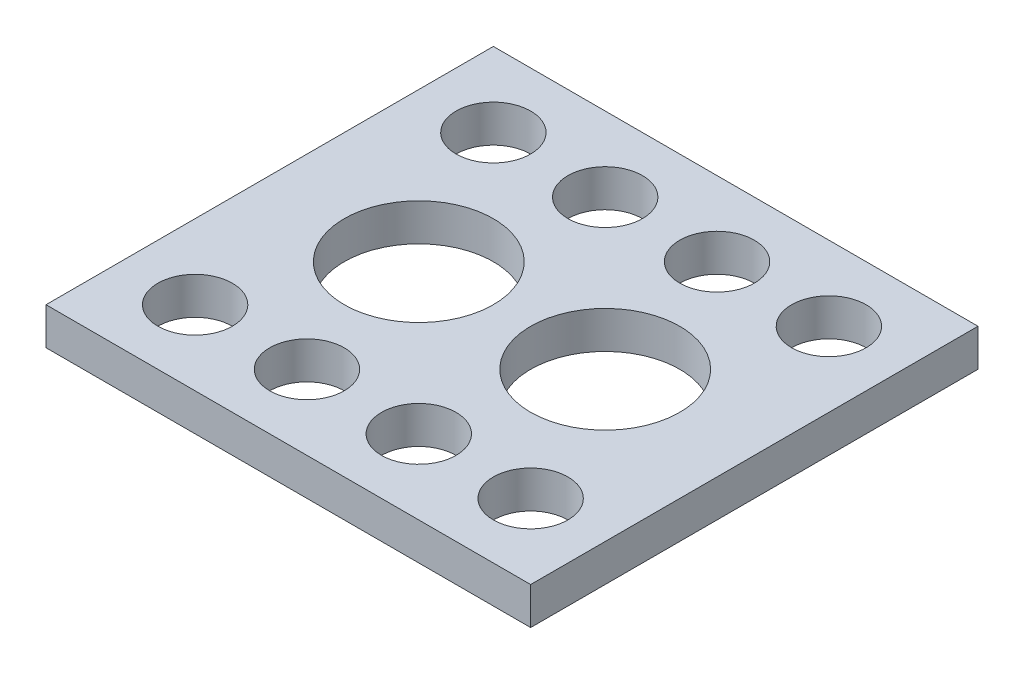
ISO-10303-21;
HEADER;
FILE_DESCRIPTION(('STEP AP214'),'2;1');
FILE_NAME('part.step','',(''),(''),'','','');
FILE_SCHEMA(('AUTOMOTIVE_DESIGN { 1 0 10303 214 1 1 1 1 }'));
ENDSEC;
DATA;
#1=APPLICATION_CONTEXT('core data for automotive mechanical design processes');
#2=APPLICATION_PROTOCOL_DEFINITION('international standard','automotive_design',2000,#1);
#3=PRODUCT_CONTEXT('',#1,'mechanical');
#4=PRODUCT('Part','Part','',(#3));
#5=PRODUCT_RELATED_PRODUCT_CATEGORY('part','',(#4));
#6=PRODUCT_DEFINITION_FORMATION('','',#4);
#7=PRODUCT_DEFINITION_CONTEXT('part definition',#1,'design');
#8=PRODUCT_DEFINITION('design','',#6,#7);
#9=PRODUCT_DEFINITION_SHAPE('','',#8);
#10=(LENGTH_UNIT() NAMED_UNIT(*) SI_UNIT(.MILLI.,.METRE.));
#11=(NAMED_UNIT(*) PLANE_ANGLE_UNIT() SI_UNIT($,.RADIAN.));
#12=(NAMED_UNIT(*) SI_UNIT($,.STERADIAN.) SOLID_ANGLE_UNIT());
#13=UNCERTAINTY_MEASURE_WITH_UNIT(LENGTH_MEASURE(1.E-05),#10,'distance_accuracy_value','');
#14=(GEOMETRIC_REPRESENTATION_CONTEXT(3) GLOBAL_UNCERTAINTY_ASSIGNED_CONTEXT((#13)) GLOBAL_UNIT_ASSIGNED_CONTEXT((#10,
#11,#12)) REPRESENTATION_CONTEXT('',''));
#15=CARTESIAN_POINT('',(0.,0.,0.));
#16=DIRECTION('',(0.,0.,1.));
#17=DIRECTION('',(1.,0.,0.));
#18=AXIS2_PLACEMENT_3D('',#15,#16,#17);
#19=CARTESIAN_POINT('',(0.,-12.7,0.));
#20=DIRECTION('',(-1.,0.,0.));
#21=DIRECTION('',(0.,0.,1.));
#22=AXIS2_PLACEMENT_3D('',#19,#20,#21);
#23=PLANE('',#22);
#24=DIRECTION('',(0.,0.,1.));
#25=VECTOR('',#24,1.);
#26=CARTESIAN_POINT('',(0.,0.,0.));
#27=LINE('',#26,#25);
#28=CARTESIAN_POINT('',(0.,0.,-152.4));
#29=VERTEX_POINT('',#28);
#30=CARTESIAN_POINT('',(0.,0.,0.));
#31=VERTEX_POINT('',#30);
#32=EDGE_CURVE('E116',#29,#31,#27,.T.);
#33=ORIENTED_EDGE('',*,*,#32,.F.);
#34=DIRECTION('',(0.,1.,0.));
#35=VECTOR('',#34,1.);
#36=CARTESIAN_POINT('',(0.,-12.7,-152.4));
#37=LINE('',#36,#35);
#38=CARTESIAN_POINT('',(0.,-12.7,-152.4));
#39=VERTEX_POINT('',#38);
#40=EDGE_CURVE('E11',#39,#29,#37,.T.);
#41=ORIENTED_EDGE('',*,*,#40,.F.);
#42=DIRECTION('',(0.,0.,1.));
#43=VECTOR('',#42,1.);
#44=CARTESIAN_POINT('',(0.,-12.7,0.));
#45=LINE('',#44,#43);
#46=CARTESIAN_POINT('',(0.,-12.7,0.));
#47=VERTEX_POINT('',#46);
#48=EDGE_CURVE('E105',#39,#47,#45,.T.);
#49=ORIENTED_EDGE('',*,*,#48,.T.);
#50=DIRECTION('',(0.,1.,0.));
#51=VECTOR('',#50,1.);
#52=CARTESIAN_POINT('',(0.,-12.7,0.));
#53=LINE('',#52,#51);
#54=EDGE_CURVE('E46',#47,#31,#53,.T.);
#55=ORIENTED_EDGE('',*,*,#54,.T.);
#56=EDGE_LOOP('',(#33,#41,#49,#55));
#57=FACE_BOUND('',#56,.T.);
#58=ADVANCED_FACE('F43',(#57),#23,.T.);
#59=CARTESIAN_POINT('',(0.,-12.7,-152.4));
#60=DIRECTION('',(0.,0.,-1.));
#61=DIRECTION('',(-1.,0.,0.));
#62=AXIS2_PLACEMENT_3D('',#59,#60,#61);
#63=PLANE('',#62);
#64=DIRECTION('',(-1.,0.,0.));
#65=VECTOR('',#64,1.);
#66=CARTESIAN_POINT('',(0.,0.,-152.4));
#67=LINE('',#66,#65);
#68=CARTESIAN_POINT('',(165.1,0.,-152.4));
#69=VERTEX_POINT('',#68);
#70=EDGE_CURVE('E110',#69,#29,#67,.T.);
#71=ORIENTED_EDGE('',*,*,#70,.F.);
#72=DIRECTION('',(0.,1.,0.));
#73=VECTOR('',#72,1.);
#74=CARTESIAN_POINT('',(165.1,-12.7,-152.4));
#75=LINE('',#74,#73);
#76=CARTESIAN_POINT('',(165.1,-12.7,-152.4));
#77=VERTEX_POINT('',#76);
#78=EDGE_CURVE('E53',#77,#69,#75,.T.);
#79=ORIENTED_EDGE('',*,*,#78,.F.);
#80=DIRECTION('',(-1.,0.,0.));
#81=VECTOR('',#80,1.);
#82=CARTESIAN_POINT('',(0.,-12.7,-152.4));
#83=LINE('',#82,#81);
#84=EDGE_CURVE('E100',#77,#39,#83,.T.);
#85=ORIENTED_EDGE('',*,*,#84,.T.);
#86=ORIENTED_EDGE('',*,*,#40,.T.);
#87=EDGE_LOOP('',(#71,#79,#85,#86));
#88=FACE_BOUND('',#87,.T.);
#89=ADVANCED_FACE('F297',(#88),#63,.T.);
#90=CARTESIAN_POINT('',(165.1,-12.7,0.));
#91=DIRECTION('',(1.,0.,0.));
#92=DIRECTION('',(0.,0.,-1.));
#93=AXIS2_PLACEMENT_3D('',#90,#91,#92);
#94=PLANE('',#93);
#95=DIRECTION('',(0.,0.,-1.));
#96=VECTOR('',#95,1.);
#97=CARTESIAN_POINT('',(165.1,0.,0.));
#98=LINE('',#97,#96);
#99=CARTESIAN_POINT('',(165.1,0.,0.));
#100=VERTEX_POINT('',#99);
#101=EDGE_CURVE('E94',#100,#69,#98,.T.);
#102=ORIENTED_EDGE('',*,*,#101,.F.);
#103=DIRECTION('',(0.,1.,0.));
#104=VECTOR('',#103,1.);
#105=CARTESIAN_POINT('',(165.1,-12.7,0.));
#106=LINE('',#105,#104);
#107=CARTESIAN_POINT('',(165.1,-12.7,0.));
#108=VERTEX_POINT('',#107);
#109=EDGE_CURVE('E89',#108,#100,#106,.T.);
#110=ORIENTED_EDGE('',*,*,#109,.F.);
#111=DIRECTION('',(0.,0.,-1.));
#112=VECTOR('',#111,1.);
#113=CARTESIAN_POINT('',(165.1,-12.7,0.));
#114=LINE('',#113,#112);
#115=EDGE_CURVE('E92',#108,#77,#114,.T.);
#116=ORIENTED_EDGE('',*,*,#115,.T.);
#117=ORIENTED_EDGE('',*,*,#78,.T.);
#118=EDGE_LOOP('',(#102,#110,#116,#117));
#119=FACE_BOUND('',#118,.T.);
#120=ADVANCED_FACE('F91',(#119),#94,.T.);
#121=CARTESIAN_POINT('',(0.,-12.7,0.));
#122=DIRECTION('',(0.,0.,1.));
#123=DIRECTION('',(1.,0.,0.));
#124=AXIS2_PLACEMENT_3D('',#121,#122,#123);
#125=PLANE('',#124);
#126=DIRECTION('',(1.,0.,0.));
#127=VECTOR('',#126,1.);
#128=CARTESIAN_POINT('',(0.,0.,0.));
#129=LINE('',#128,#127);
#130=EDGE_CURVE('E120',#31,#100,#129,.T.);
#131=ORIENTED_EDGE('',*,*,#130,.F.);
#132=ORIENTED_EDGE('',*,*,#54,.F.);
#133=DIRECTION('',(1.,0.,0.));
#134=VECTOR('',#133,1.);
#135=CARTESIAN_POINT('',(0.,-12.7,0.));
#136=LINE('',#135,#134);
#137=EDGE_CURVE('E99',#47,#108,#136,.T.);
#138=ORIENTED_EDGE('',*,*,#137,.T.);
#139=ORIENTED_EDGE('',*,*,#109,.T.);
#140=EDGE_LOOP('',(#131,#132,#138,#139));
#141=FACE_BOUND('',#140,.T.);
#142=ADVANCED_FACE('F103',(#141),#125,.T.);
#143=CARTESIAN_POINT('',(0.,-12.7,0.));
#144=DIRECTION('',(0.,-1.,0.));
#145=DIRECTION('',(0.,0.,-1.));
#146=AXIS2_PLACEMENT_3D('',#143,#144,#145);
#147=PLANE('',#146);
#148=CARTESIAN_POINT('',(50.8,-12.7,-76.2));
#149=DIRECTION('',(0.,1.,0.));
#150=DIRECTION('',(0.,0.,1.));
#151=AXIS2_PLACEMENT_3D('',#148,#149,#150);
#152=CIRCLE('',#151,25.4);
#153=CARTESIAN_POINT('',(50.8,-12.7,-50.8));
#154=VERTEX_POINT('',#153);
#155=EDGE_CURVE('E246',#154,#154,#152,.T.);
#156=ORIENTED_EDGE('',*,*,#155,.T.);
#157=EDGE_LOOP('',(#156));
#158=FACE_BOUND('',#157,.T.);
#159=CARTESIAN_POINT('',(114.3,-12.7,-76.2));
#160=DIRECTION('',(0.,1.,0.));
#161=DIRECTION('',(0.,0.,1.));
#162=AXIS2_PLACEMENT_3D('',#159,#160,#161);
#163=CIRCLE('',#162,25.4);
#164=CARTESIAN_POINT('',(114.3,-12.7,-50.8));
#165=VERTEX_POINT('',#164);
#166=EDGE_CURVE('E258',#165,#165,#163,.T.);
#167=ORIENTED_EDGE('',*,*,#166,.T.);
#168=EDGE_LOOP('',(#167));
#169=FACE_BOUND('',#168,.T.);
#170=CARTESIAN_POINT('',(63.5000000000011,-12.7,-25.4));
#171=DIRECTION('',(0.,1.,0.));
#172=DIRECTION('',(0.,0.,1.));
#173=AXIS2_PLACEMENT_3D('',#170,#171,#172);
#174=CIRCLE('',#173,12.7);
#175=CARTESIAN_POINT('',(63.5000000000011,-12.7,-12.7));
#176=VERTEX_POINT('',#175);
#177=EDGE_CURVE('E198',#176,#176,#174,.T.);
#178=ORIENTED_EDGE('',*,*,#177,.T.);
#179=EDGE_LOOP('',(#178));
#180=FACE_BOUND('',#179,.T.);
#181=CARTESIAN_POINT('',(139.7,-12.7,-127.));
#182=DIRECTION('',(0.,1.,0.));
#183=DIRECTION('',(0.,0.,1.));
#184=AXIS2_PLACEMENT_3D('',#181,#182,#183);
#185=CIRCLE('',#184,12.7);
#186=CARTESIAN_POINT('',(139.7,-12.7,-114.3));
#187=VERTEX_POINT('',#186);
#188=EDGE_CURVE('E186',#187,#187,#185,.T.);
#189=ORIENTED_EDGE('',*,*,#188,.T.);
#190=EDGE_LOOP('',(#189));
#191=FACE_BOUND('',#190,.T.);
#192=CARTESIAN_POINT('',(101.6,-12.7,-127.));
#193=DIRECTION('',(0.,1.,0.));
#194=DIRECTION('',(0.,0.,1.));
#195=AXIS2_PLACEMENT_3D('',#192,#193,#194);
#196=CIRCLE('',#195,12.7);
#197=CARTESIAN_POINT('',(101.6,-12.7,-114.3));
#198=VERTEX_POINT('',#197);
#199=EDGE_CURVE('E174',#198,#198,#196,.T.);
#200=ORIENTED_EDGE('',*,*,#199,.T.);
#201=EDGE_LOOP('',(#200));
#202=FACE_BOUND('',#201,.T.);
#203=CARTESIAN_POINT('',(63.5,-12.7,-127.));
#204=DIRECTION('',(0.,1.,0.));
#205=DIRECTION('',(0.,0.,1.));
#206=AXIS2_PLACEMENT_3D('',#203,#204,#205);
#207=CIRCLE('',#206,12.7);
#208=CARTESIAN_POINT('',(63.5,-12.7,-114.3));
#209=VERTEX_POINT('',#208);
#210=EDGE_CURVE('E163',#209,#209,#207,.T.);
#211=ORIENTED_EDGE('',*,*,#210,.T.);
#212=EDGE_LOOP('',(#211));
#213=FACE_BOUND('',#212,.T.);
#214=CARTESIAN_POINT('',(101.600000000001,-12.7,-25.4));
#215=DIRECTION('',(0.,1.,0.));
#216=DIRECTION('',(0.,0.,1.));
#217=AXIS2_PLACEMENT_3D('',#214,#215,#216);
#218=CIRCLE('',#217,12.7);
#219=CARTESIAN_POINT('',(101.600000000001,-12.7,-12.7));
#220=VERTEX_POINT('',#219);
#221=EDGE_CURVE('E210',#220,#220,#218,.T.);
#222=ORIENTED_EDGE('',*,*,#221,.T.);
#223=EDGE_LOOP('',(#222));
#224=FACE_BOUND('',#223,.T.);
#225=CARTESIAN_POINT('',(139.700000000001,-12.7,-25.4));
#226=DIRECTION('',(0.,1.,0.));
#227=DIRECTION('',(0.,0.,1.));
#228=AXIS2_PLACEMENT_3D('',#225,#226,#227);
#229=CIRCLE('',#228,12.7);
#230=CARTESIAN_POINT('',(139.700000000001,-12.7,-12.7));
#231=VERTEX_POINT('',#230);
#232=EDGE_CURVE('E222',#231,#231,#229,.T.);
#233=ORIENTED_EDGE('',*,*,#232,.T.);
#234=EDGE_LOOP('',(#233));
#235=FACE_BOUND('',#234,.T.);
#236=CARTESIAN_POINT('',(25.4000000000011,-12.7,-25.4));
#237=DIRECTION('',(0.,1.,0.));
#238=DIRECTION('',(0.,0.,1.));
#239=AXIS2_PLACEMENT_3D('',#236,#237,#238);
#240=CIRCLE('',#239,12.7);
#241=CARTESIAN_POINT('',(25.4000000000011,-12.7,-12.7));
#242=VERTEX_POINT('',#241);
#243=EDGE_CURVE('E234',#242,#242,#240,.T.);
#244=ORIENTED_EDGE('',*,*,#243,.T.);
#245=EDGE_LOOP('',(#244));
#246=FACE_BOUND('',#245,.T.);
#247=CARTESIAN_POINT('',(25.4,-12.7,-127.));
#248=DIRECTION('',(0.,1.,0.));
#249=DIRECTION('',(0.,0.,1.));
#250=AXIS2_PLACEMENT_3D('',#247,#248,#249);
#251=CIRCLE('',#250,12.7);
#252=CARTESIAN_POINT('',(25.4,-12.7,-114.3));
#253=VERTEX_POINT('',#252);
#254=EDGE_CURVE('E121',#253,#253,#251,.T.);
#255=ORIENTED_EDGE('',*,*,#254,.T.);
#256=EDGE_LOOP('',(#255));
#257=FACE_BOUND('',#256,.T.);
#258=ORIENTED_EDGE('',*,*,#48,.F.);
#259=ORIENTED_EDGE('',*,*,#84,.F.);
#260=ORIENTED_EDGE('',*,*,#115,.F.);
#261=ORIENTED_EDGE('',*,*,#137,.F.);
#262=EDGE_LOOP('',(#258,#259,#260,#261));
#263=FACE_BOUND('',#262,.T.);
#264=ADVANCED_FACE('F98',(#158,#169,#180,#191,#202,#213,#224,#235,#246,#257,#263),#147,.T.);
#265=CARTESIAN_POINT('',(0.,0.,0.));
#266=DIRECTION('',(0.,-1.,0.));
#267=DIRECTION('',(0.,0.,-1.));
#268=AXIS2_PLACEMENT_3D('',#265,#266,#267);
#269=PLANE('',#268);
#270=CARTESIAN_POINT('',(50.8,0.,-76.2));
#271=DIRECTION('',(0.,1.,0.));
#272=DIRECTION('',(0.,0.,1.));
#273=AXIS2_PLACEMENT_3D('',#270,#271,#272);
#274=CIRCLE('',#273,25.4);
#275=CARTESIAN_POINT('',(50.8,0.,-50.8));
#276=VERTEX_POINT('',#275);
#277=EDGE_CURVE('E252',#276,#276,#274,.T.);
#278=ORIENTED_EDGE('',*,*,#277,.F.);
#279=EDGE_LOOP('',(#278));
#280=FACE_BOUND('',#279,.T.);
#281=CARTESIAN_POINT('',(114.3,0.,-76.2));
#282=DIRECTION('',(0.,1.,0.));
#283=DIRECTION('',(0.,0.,1.));
#284=AXIS2_PLACEMENT_3D('',#281,#282,#283);
#285=CIRCLE('',#284,25.4);
#286=CARTESIAN_POINT('',(114.3,0.,-50.8));
#287=VERTEX_POINT('',#286);
#288=EDGE_CURVE('E264',#287,#287,#285,.T.);
#289=ORIENTED_EDGE('',*,*,#288,.F.);
#290=EDGE_LOOP('',(#289));
#291=FACE_BOUND('',#290,.T.);
#292=CARTESIAN_POINT('',(63.5000000000011,0.,-25.4));
#293=DIRECTION('',(0.,1.,0.));
#294=DIRECTION('',(0.,0.,1.));
#295=AXIS2_PLACEMENT_3D('',#292,#293,#294);
#296=CIRCLE('',#295,12.7);
#297=CARTESIAN_POINT('',(63.5000000000011,0.,-12.7));
#298=VERTEX_POINT('',#297);
#299=EDGE_CURVE('E204',#298,#298,#296,.T.);
#300=ORIENTED_EDGE('',*,*,#299,.F.);
#301=EDGE_LOOP('',(#300));
#302=FACE_BOUND('',#301,.T.);
#303=CARTESIAN_POINT('',(139.7,0.,-127.));
#304=DIRECTION('',(0.,1.,0.));
#305=DIRECTION('',(0.,0.,1.));
#306=AXIS2_PLACEMENT_3D('',#303,#304,#305);
#307=CIRCLE('',#306,12.7);
#308=CARTESIAN_POINT('',(139.7,0.,-114.3));
#309=VERTEX_POINT('',#308);
#310=EDGE_CURVE('E192',#309,#309,#307,.T.);
#311=ORIENTED_EDGE('',*,*,#310,.F.);
#312=EDGE_LOOP('',(#311));
#313=FACE_BOUND('',#312,.T.);
#314=CARTESIAN_POINT('',(101.6,0.,-127.));
#315=DIRECTION('',(0.,1.,0.));
#316=DIRECTION('',(0.,0.,1.));
#317=AXIS2_PLACEMENT_3D('',#314,#315,#316);
#318=CIRCLE('',#317,12.7);
#319=CARTESIAN_POINT('',(101.6,0.,-114.3));
#320=VERTEX_POINT('',#319);
#321=EDGE_CURVE('E180',#320,#320,#318,.T.);
#322=ORIENTED_EDGE('',*,*,#321,.F.);
#323=EDGE_LOOP('',(#322));
#324=FACE_BOUND('',#323,.T.);
#325=CARTESIAN_POINT('',(63.5,0.,-127.));
#326=DIRECTION('',(0.,1.,0.));
#327=DIRECTION('',(0.,0.,1.));
#328=AXIS2_PLACEMENT_3D('',#325,#326,#327);
#329=CIRCLE('',#328,12.7);
#330=CARTESIAN_POINT('',(63.5,0.,-114.3));
#331=VERTEX_POINT('',#330);
#332=EDGE_CURVE('E168',#331,#331,#329,.T.);
#333=ORIENTED_EDGE('',*,*,#332,.F.);
#334=EDGE_LOOP('',(#333));
#335=FACE_BOUND('',#334,.T.);
#336=CARTESIAN_POINT('',(101.600000000001,0.,-25.4));
#337=DIRECTION('',(0.,1.,0.));
#338=DIRECTION('',(0.,0.,1.));
#339=AXIS2_PLACEMENT_3D('',#336,#337,#338);
#340=CIRCLE('',#339,12.7);
#341=CARTESIAN_POINT('',(101.600000000001,0.,-12.7));
#342=VERTEX_POINT('',#341);
#343=EDGE_CURVE('E216',#342,#342,#340,.T.);
#344=ORIENTED_EDGE('',*,*,#343,.F.);
#345=EDGE_LOOP('',(#344));
#346=FACE_BOUND('',#345,.T.);
#347=CARTESIAN_POINT('',(139.700000000001,0.,-25.4));
#348=DIRECTION('',(0.,1.,0.));
#349=DIRECTION('',(0.,0.,1.));
#350=AXIS2_PLACEMENT_3D('',#347,#348,#349);
#351=CIRCLE('',#350,12.7);
#352=CARTESIAN_POINT('',(139.700000000001,0.,-12.7));
#353=VERTEX_POINT('',#352);
#354=EDGE_CURVE('E228',#353,#353,#351,.T.);
#355=ORIENTED_EDGE('',*,*,#354,.F.);
#356=EDGE_LOOP('',(#355));
#357=FACE_BOUND('',#356,.T.);
#358=CARTESIAN_POINT('',(25.4000000000011,0.,-25.4));
#359=DIRECTION('',(0.,1.,0.));
#360=DIRECTION('',(0.,0.,1.));
#361=AXIS2_PLACEMENT_3D('',#358,#359,#360);
#362=CIRCLE('',#361,12.7);
#363=CARTESIAN_POINT('',(25.4000000000011,0.,-12.7));
#364=VERTEX_POINT('',#363);
#365=EDGE_CURVE('E240',#364,#364,#362,.T.);
#366=ORIENTED_EDGE('',*,*,#365,.F.);
#367=EDGE_LOOP('',(#366));
#368=FACE_BOUND('',#367,.T.);
#369=CARTESIAN_POINT('',(25.4,0.,-127.));
#370=DIRECTION('',(0.,1.,0.));
#371=DIRECTION('',(0.,0.,1.));
#372=AXIS2_PLACEMENT_3D('',#369,#370,#371);
#373=CIRCLE('',#372,12.7);
#374=CARTESIAN_POINT('',(25.4,0.,-114.3));
#375=VERTEX_POINT('',#374);
#376=EDGE_CURVE('E157',#375,#375,#373,.T.);
#377=ORIENTED_EDGE('',*,*,#376,.F.);
#378=EDGE_LOOP('',(#377));
#379=FACE_BOUND('',#378,.T.);
#380=ORIENTED_EDGE('',*,*,#32,.T.);
#381=ORIENTED_EDGE('',*,*,#130,.T.);
#382=ORIENTED_EDGE('',*,*,#101,.T.);
#383=ORIENTED_EDGE('',*,*,#70,.T.);
#384=EDGE_LOOP('',(#380,#381,#382,#383));
#385=FACE_BOUND('',#384,.T.);
#386=ADVANCED_FACE('F275',(#280,#291,#302,#313,#324,#335,#346,#357,#368,#379,#385),#269,.F.);
#387=CARTESIAN_POINT('',(25.4,-12.7,-127.));
#388=DIRECTION('',(0.,1.,0.));
#389=DIRECTION('',(0.,0.,1.));
#390=AXIS2_PLACEMENT_3D('',#387,#388,#389);
#391=CYLINDRICAL_SURFACE('',#390,12.7);
#392=ORIENTED_EDGE('',*,*,#254,.F.);
#393=EDGE_LOOP('',(#392));
#394=FACE_BOUND('',#393,.T.);
#395=ORIENTED_EDGE('',*,*,#376,.T.);
#396=EDGE_LOOP('',(#395));
#397=FACE_BOUND('',#396,.T.);
#398=ADVANCED_FACE('F278',(#394,#397),#391,.F.);
#399=CARTESIAN_POINT('',(25.4000000000011,-12.7,-25.4));
#400=DIRECTION('',(0.,1.,0.));
#401=DIRECTION('',(0.,0.,1.));
#402=AXIS2_PLACEMENT_3D('',#399,#400,#401);
#403=CYLINDRICAL_SURFACE('',#402,12.7);
#404=ORIENTED_EDGE('',*,*,#243,.F.);
#405=EDGE_LOOP('',(#404));
#406=FACE_BOUND('',#405,.T.);
#407=ORIENTED_EDGE('',*,*,#365,.T.);
#408=EDGE_LOOP('',(#407));
#409=FACE_BOUND('',#408,.T.);
#410=ADVANCED_FACE('F317',(#406,#409),#403,.F.);
#411=CARTESIAN_POINT('',(139.700000000001,-12.7,-25.4));
#412=DIRECTION('',(0.,1.,0.));
#413=DIRECTION('',(0.,0.,1.));
#414=AXIS2_PLACEMENT_3D('',#411,#412,#413);
#415=CYLINDRICAL_SURFACE('',#414,12.7);
#416=ORIENTED_EDGE('',*,*,#232,.F.);
#417=EDGE_LOOP('',(#416));
#418=FACE_BOUND('',#417,.T.);
#419=ORIENTED_EDGE('',*,*,#354,.T.);
#420=EDGE_LOOP('',(#419));
#421=FACE_BOUND('',#420,.T.);
#422=ADVANCED_FACE('F338',(#418,#421),#415,.F.);
#423=CARTESIAN_POINT('',(101.600000000001,-12.7,-25.4));
#424=DIRECTION('',(0.,1.,0.));
#425=DIRECTION('',(0.,0.,1.));
#426=AXIS2_PLACEMENT_3D('',#423,#424,#425);
#427=CYLINDRICAL_SURFACE('',#426,12.7);
#428=ORIENTED_EDGE('',*,*,#221,.F.);
#429=EDGE_LOOP('',(#428));
#430=FACE_BOUND('',#429,.T.);
#431=ORIENTED_EDGE('',*,*,#343,.T.);
#432=EDGE_LOOP('',(#431));
#433=FACE_BOUND('',#432,.T.);
#434=ADVANCED_FACE('F327',(#430,#433),#427,.F.);
#435=CARTESIAN_POINT('',(63.5,-12.7,-127.));
#436=DIRECTION('',(0.,1.,0.));
#437=DIRECTION('',(0.,0.,1.));
#438=AXIS2_PLACEMENT_3D('',#435,#436,#437);
#439=CYLINDRICAL_SURFACE('',#438,12.7);
#440=ORIENTED_EDGE('',*,*,#210,.F.);
#441=EDGE_LOOP('',(#440));
#442=FACE_BOUND('',#441,.T.);
#443=ORIENTED_EDGE('',*,*,#332,.T.);
#444=EDGE_LOOP('',(#443));
#445=FACE_BOUND('',#444,.T.);
#446=ADVANCED_FACE('F323',(#442,#445),#439,.F.);
#447=CARTESIAN_POINT('',(101.6,-12.7,-127.));
#448=DIRECTION('',(0.,1.,0.));
#449=DIRECTION('',(0.,0.,1.));
#450=AXIS2_PLACEMENT_3D('',#447,#448,#449);
#451=CYLINDRICAL_SURFACE('',#450,12.7);
#452=ORIENTED_EDGE('',*,*,#199,.F.);
#453=EDGE_LOOP('',(#452));
#454=FACE_BOUND('',#453,.T.);
#455=ORIENTED_EDGE('',*,*,#321,.T.);
#456=EDGE_LOOP('',(#455));
#457=FACE_BOUND('',#456,.T.);
#458=ADVANCED_FACE('F319',(#454,#457),#451,.F.);
#459=CARTESIAN_POINT('',(139.7,-12.7,-127.));
#460=DIRECTION('',(0.,1.,0.));
#461=DIRECTION('',(0.,0.,1.));
#462=AXIS2_PLACEMENT_3D('',#459,#460,#461);
#463=CYLINDRICAL_SURFACE('',#462,12.7);
#464=ORIENTED_EDGE('',*,*,#188,.F.);
#465=EDGE_LOOP('',(#464));
#466=FACE_BOUND('',#465,.T.);
#467=ORIENTED_EDGE('',*,*,#310,.T.);
#468=EDGE_LOOP('',(#467));
#469=FACE_BOUND('',#468,.T.);
#470=ADVANCED_FACE('F322',(#466,#469),#463,.F.);
#471=CARTESIAN_POINT('',(63.5000000000011,-12.7,-25.4));
#472=DIRECTION('',(0.,1.,0.));
#473=DIRECTION('',(0.,0.,1.));
#474=AXIS2_PLACEMENT_3D('',#471,#472,#473);
#475=CYLINDRICAL_SURFACE('',#474,12.7);
#476=ORIENTED_EDGE('',*,*,#177,.F.);
#477=EDGE_LOOP('',(#476));
#478=FACE_BOUND('',#477,.T.);
#479=ORIENTED_EDGE('',*,*,#299,.T.);
#480=EDGE_LOOP('',(#479));
#481=FACE_BOUND('',#480,.T.);
#482=ADVANCED_FACE('F329',(#478,#481),#475,.F.);
#483=CARTESIAN_POINT('',(114.3,-12.7,-76.2));
#484=DIRECTION('',(0.,1.,0.));
#485=DIRECTION('',(0.,0.,1.));
#486=AXIS2_PLACEMENT_3D('',#483,#484,#485);
#487=CYLINDRICAL_SURFACE('',#486,25.4);
#488=ORIENTED_EDGE('',*,*,#166,.F.);
#489=EDGE_LOOP('',(#488));
#490=FACE_BOUND('',#489,.T.);
#491=ORIENTED_EDGE('',*,*,#288,.T.);
#492=EDGE_LOOP('',(#491));
#493=FACE_BOUND('',#492,.T.);
#494=ADVANCED_FACE('F273',(#490,#493),#487,.F.);
#495=CARTESIAN_POINT('',(50.8,-12.7,-76.2));
#496=DIRECTION('',(0.,1.,0.));
#497=DIRECTION('',(0.,0.,1.));
#498=AXIS2_PLACEMENT_3D('',#495,#496,#497);
#499=CYLINDRICAL_SURFACE('',#498,25.4);
#500=ORIENTED_EDGE('',*,*,#155,.F.);
#501=EDGE_LOOP('',(#500));
#502=FACE_BOUND('',#501,.T.);
#503=ORIENTED_EDGE('',*,*,#277,.T.);
#504=EDGE_LOOP('',(#503));
#505=FACE_BOUND('',#504,.T.);
#506=ADVANCED_FACE('F348',(#502,#505),#499,.F.);
#507=CLOSED_SHELL('',(#58,#89,#120,#142,#264,#386,#398,#410,#422,#434,#446,#458,#470,#482,#494,#506));
#508=MANIFOLD_SOLID_BREP('B2',#507);
#509=ADVANCED_BREP_SHAPE_REPRESENTATION('',(#18,#508),#14);
#510=SHAPE_DEFINITION_REPRESENTATION(#9,#509);
ENDSEC;
END-ISO-10303-21;
